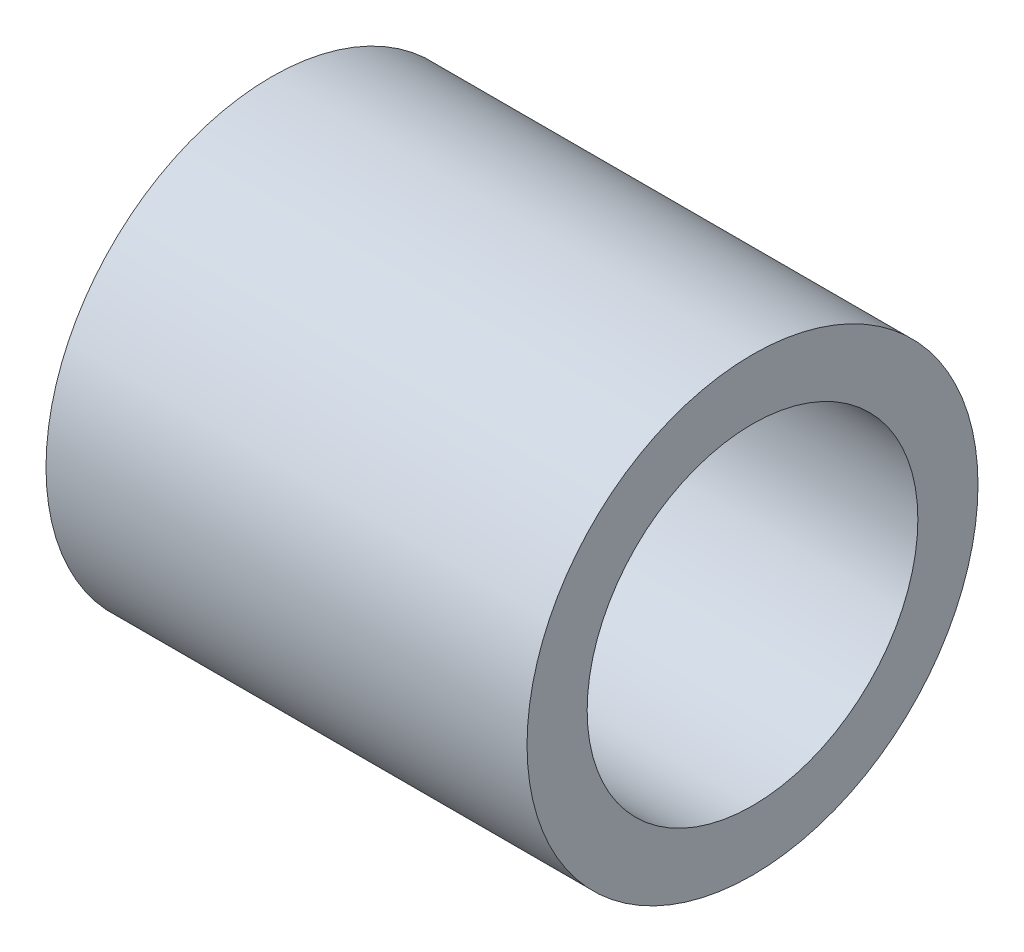
ISO-10303-21;
HEADER;
FILE_DESCRIPTION(('STEP AP214'),'2;1');
FILE_NAME('part.step','',(''),(''),'','','');
FILE_SCHEMA(('AUTOMOTIVE_DESIGN { 1 0 10303 214 1 1 1 1 }'));
ENDSEC;
DATA;
#1=APPLICATION_CONTEXT('core data for automotive mechanical design processes');
#2=APPLICATION_PROTOCOL_DEFINITION('international standard','automotive_design',2000,#1);
#3=PRODUCT_CONTEXT('',#1,'mechanical');
#4=PRODUCT('Part','Part','',(#3));
#5=PRODUCT_RELATED_PRODUCT_CATEGORY('part','',(#4));
#6=PRODUCT_DEFINITION_FORMATION('','',#4);
#7=PRODUCT_DEFINITION_CONTEXT('part definition',#1,'design');
#8=PRODUCT_DEFINITION('design','',#6,#7);
#9=PRODUCT_DEFINITION_SHAPE('','',#8);
#10=(LENGTH_UNIT() NAMED_UNIT(*) SI_UNIT(.MILLI.,.METRE.));
#11=(NAMED_UNIT(*) PLANE_ANGLE_UNIT() SI_UNIT($,.RADIAN.));
#12=(NAMED_UNIT(*) SI_UNIT($,.STERADIAN.) SOLID_ANGLE_UNIT());
#13=UNCERTAINTY_MEASURE_WITH_UNIT(LENGTH_MEASURE(1.E-05),#10,'distance_accuracy_value','');
#14=(GEOMETRIC_REPRESENTATION_CONTEXT(3) GLOBAL_UNCERTAINTY_ASSIGNED_CONTEXT((#13)) GLOBAL_UNIT_ASSIGNED_CONTEXT((#10,
#11,#12)) REPRESENTATION_CONTEXT('',''));
#15=CARTESIAN_POINT('',(0.,0.,0.));
#16=DIRECTION('',(0.,0.,1.));
#17=DIRECTION('',(1.,0.,0.));
#18=AXIS2_PLACEMENT_3D('',#15,#16,#17);
#19=CARTESIAN_POINT('',(-2.5,0.,0.));
#20=DIRECTION('',(-1.,0.,0.));
#21=DIRECTION('',(0.,0.,1.));
#22=AXIS2_PLACEMENT_3D('',#19,#20,#21);
#23=PLANE('',#22);
#24=CARTESIAN_POINT('',(-2.5,0.,0.));
#25=DIRECTION('',(-1.,0.,0.));
#26=DIRECTION('',(0.,0.,1.));
#27=AXIS2_PLACEMENT_3D('',#24,#25,#26);
#28=CIRCLE('',#27,37.5);
#29=CARTESIAN_POINT('',(-2.5,0.,37.5));
#30=VERTEX_POINT('',#29);
#31=EDGE_CURVE('E10',#30,#30,#28,.T.);
#32=ORIENTED_EDGE('',*,*,#31,.T.);
#33=EDGE_LOOP('',(#32));
#34=FACE_BOUND('',#33,.T.);
#35=CARTESIAN_POINT('',(-2.5,0.,0.));
#36=DIRECTION('',(-1.,0.,0.));
#37=DIRECTION('',(0.,0.,1.));
#38=AXIS2_PLACEMENT_3D('',#35,#36,#37);
#39=CIRCLE('',#38,27.5);
#40=CARTESIAN_POINT('',(-2.5,0.,27.5));
#41=VERTEX_POINT('',#40);
#42=EDGE_CURVE('E58',#41,#41,#39,.T.);
#43=ORIENTED_EDGE('',*,*,#42,.F.);
#44=EDGE_LOOP('',(#43));
#45=FACE_BOUND('',#44,.T.);
#46=ADVANCED_FACE('F42',(#34,#45),#23,.T.);
#47=CARTESIAN_POINT('',(77.5,0.,0.));
#48=DIRECTION('',(-1.,0.,0.));
#49=DIRECTION('',(0.,0.,1.));
#50=AXIS2_PLACEMENT_3D('',#47,#48,#49);
#51=PLANE('',#50);
#52=CARTESIAN_POINT('',(77.5,0.,0.));
#53=DIRECTION('',(-1.,0.,0.));
#54=DIRECTION('',(0.,0.,1.));
#55=AXIS2_PLACEMENT_3D('',#52,#53,#54);
#56=CIRCLE('',#55,37.5);
#57=CARTESIAN_POINT('',(77.5,0.,37.5));
#58=VERTEX_POINT('',#57);
#59=EDGE_CURVE('E47',#58,#58,#56,.T.);
#60=ORIENTED_EDGE('',*,*,#59,.F.);
#61=EDGE_LOOP('',(#60));
#62=FACE_BOUND('',#61,.T.);
#63=CARTESIAN_POINT('',(77.5,0.,0.));
#64=DIRECTION('',(-1.,0.,0.));
#65=DIRECTION('',(0.,0.,1.));
#66=AXIS2_PLACEMENT_3D('',#63,#64,#65);
#67=CIRCLE('',#66,27.5);
#68=CARTESIAN_POINT('',(77.5,0.,27.5));
#69=VERTEX_POINT('',#68);
#70=EDGE_CURVE('E60',#69,#69,#67,.T.);
#71=ORIENTED_EDGE('',*,*,#70,.T.);
#72=EDGE_LOOP('',(#71));
#73=FACE_BOUND('',#72,.T.);
#74=ADVANCED_FACE('F91',(#62,#73),#51,.F.);
#75=CARTESIAN_POINT('',(-2.5,0.,0.));
#76=DIRECTION('',(1.,0.,0.));
#77=DIRECTION('',(0.,0.,-1.));
#78=AXIS2_PLACEMENT_3D('',#75,#76,#77);
#79=CYLINDRICAL_SURFACE('',#78,37.5);
#80=CARTESIAN_POINT('',(24.1,0.,-37.5));
#81=CARTESIAN_POINT('',(24.1000082945985,-0.190559723164768,-37.4999979936604));
#82=CARTESIAN_POINT('',(24.1160743538321,-0.381247611908918,-37.4985320160825));
#83=CARTESIAN_POINT('',(24.1799259758223,-0.757342986444864,-37.4928248970775));
#84=CARTESIAN_POINT('',(24.2277470612038,-0.942744315935858,-37.4885806478242));
#85=CARTESIAN_POINT('',(24.3537105804242,-1.30276543085249,-37.4777963886925));
#86=CARTESIAN_POINT('',(24.431835373654,-1.47739142047119,-37.4712577146716));
#87=CARTESIAN_POINT('',(24.6161559263007,-1.81101129714627,-37.4566169886113));
#88=CARTESIAN_POINT('',(24.7223458581285,-1.97000842006819,-37.4485152612264));
#89=CARTESIAN_POINT('',(24.9601239554859,-2.26837251618839,-37.4316298201157));
#90=CARTESIAN_POINT('',(25.0917787478352,-2.40768629751925,-37.4228443542909));
#91=CARTESIAN_POINT('',(25.3766079311434,-2.66227235210448,-37.405596223706));
#92=CARTESIAN_POINT('',(25.5297832874134,-2.77754354634513,-37.3971335734475));
#93=CARTESIAN_POINT('',(25.8536326129838,-2.98095621962976,-37.3814708573294));
#94=CARTESIAN_POINT('',(26.0243364624897,-3.06905031212187,-37.3742730060971));
#95=CARTESIAN_POINT('',(26.3781893284178,-3.21530548089095,-37.3619757110452));
#96=CARTESIAN_POINT('',(26.5613380884652,-3.27346717358699,-37.356876224013));
#97=CARTESIAN_POINT('',(26.9343443708035,-3.35805067815647,-37.3493683000558));
#98=CARTESIAN_POINT('',(27.1241819225011,-3.38455989016692,-37.3469524542422));
#99=CARTESIAN_POINT('',(27.5056261261671,-3.4053560091084,-37.3450621266294));
#100=CARTESIAN_POINT('',(27.6972327392963,-3.39964362178283,-37.3455875804073));
#101=CARTESIAN_POINT('',(28.076175639252,-3.35623084372738,-37.3495137334145));
#102=CARTESIAN_POINT('',(28.2635229300826,-3.31862562307997,-37.3529058781636));
#103=CARTESIAN_POINT('',(28.6292357310132,-3.21264260375577,-37.3621698121043));
#104=CARTESIAN_POINT('',(28.8076011392711,-3.1442644562436,-37.3680416294049));
#105=CARTESIAN_POINT('',(29.1505892209115,-2.97857066105852,-37.3816131526676));
#106=CARTESIAN_POINT('',(29.3151912526011,-2.88121251336735,-37.3893155398465));
#107=CARTESIAN_POINT('',(29.6257543422296,-2.66035295305758,-37.405677957123));
#108=CARTESIAN_POINT('',(29.7717149522195,-2.53685091239689,-37.4143380102238));
#109=CARTESIAN_POINT('',(30.0414051370892,-2.26667648663797,-37.4316780791412));
#110=CARTESIAN_POINT('',(30.1650523414482,-2.11992186105972,-37.4403580537721));
#111=CARTESIAN_POINT('',(30.3859683010405,-1.80769444233154,-37.4567302086562));
#112=CARTESIAN_POINT('',(30.4832370340864,-1.64222163343754,-37.4644223880785));
#113=CARTESIAN_POINT('',(30.6486305832094,-1.29719999747567,-37.4779541452752));
#114=CARTESIAN_POINT('',(30.7167515292785,-1.11764930500237,-37.4837934770168));
#115=CARTESIAN_POINT('',(30.8218570049296,-0.749594234679214,-37.4929589304417));
#116=CARTESIAN_POINT('',(30.8588422995978,-0.561090076960212,-37.4962851138796));
#117=CARTESIAN_POINT('',(30.9005228112243,-0.181192721220252,-37.5000415745191));
#118=CARTESIAN_POINT('',(30.9053317572028,0.0101879024191437,-37.5004820512895));
#119=CARTESIAN_POINT('',(30.8828213176841,0.391032525671056,-37.4984447554869));
#120=CARTESIAN_POINT('',(30.855502287849,0.580496546477275,-37.4959670152191));
#121=CARTESIAN_POINT('',(30.7696056838689,0.951803835993026,-37.4883783880999));
#122=CARTESIAN_POINT('',(30.7110810486894,1.1336594502153,-37.4832719612077));
#123=CARTESIAN_POINT('',(30.5644887427421,1.48497068650434,-37.4709992727654));
#124=CARTESIAN_POINT('',(30.4764205224644,1.65442607785589,-37.4638329729021));
#125=CARTESIAN_POINT('',(30.2729567466451,1.97664281381885,-37.4482177206628));
#126=CARTESIAN_POINT('',(30.1574861072022,2.12935657436759,-37.4397652674117));
#127=CARTESIAN_POINT('',(29.9026034052353,2.4132741751186,-37.4225383699781));
#128=CARTESIAN_POINT('',(29.7631908499511,2.54447757249701,-37.4137639191713));
#129=CARTESIAN_POINT('',(29.4638870674841,2.78204217195324,-37.3968515560699));
#130=CARTESIAN_POINT('',(29.3039366662132,2.88832898001984,-37.3887155970567));
#131=CARTESIAN_POINT('',(28.9683910149125,3.07253266468952,-37.3740299952077));
#132=CARTESIAN_POINT('',(28.7927959455174,3.15044986879775,-37.3674803340596));
#133=CARTESIAN_POINT('',(28.4312054090705,3.27557674616618,-37.3567204436657));
#134=CARTESIAN_POINT('',(28.2452256224982,3.32283142588881,-37.3525067869617));
#135=CARTESIAN_POINT('',(27.867931462473,3.38543819483056,-37.3468849024037));
#136=CARTESIAN_POINT('',(27.6766172125831,3.40079102237681,-37.3454766096231));
#137=CARTESIAN_POINT('',(27.2948241798513,3.39914904180154,-37.3456260408182));
#138=CARTESIAN_POINT('',(27.104344879313,3.38227110956999,-37.3471730482269));
#139=CARTESIAN_POINT('',(26.7289386875149,3.31689098464511,-37.3530359694837));
#140=CARTESIAN_POINT('',(26.5440118038703,3.26838874858054,-37.3573518871293));
#141=CARTESIAN_POINT('',(26.1849558534423,3.14116756200052,-37.3682634526361));
#142=CARTESIAN_POINT('',(26.0108258318946,3.06245128774545,-37.3748588985791));
#143=CARTESIAN_POINT('',(25.678232363726,2.87704905891663,-37.389586767059));
#144=CARTESIAN_POINT('',(25.5197687376125,2.77036342484393,-37.3977191719837));
#145=CARTESIAN_POINT('',(25.2224075495852,2.5316114597032,-37.4146398485466));
#146=CARTESIAN_POINT('',(25.0835798394473,2.39945828320324,-37.4234302995562));
#147=CARTESIAN_POINT('',(24.8300152242307,2.11368749589016,-37.4406566524408));
#148=CARTESIAN_POINT('',(24.7152841311393,1.96006472156028,-37.4490924683881));
#149=CARTESIAN_POINT('',(24.5129856074485,1.63536710454836,-37.4646770938458));
#150=CARTESIAN_POINT('',(24.4254766147713,1.46425575021596,-37.4718231209471));
#151=CARTESIAN_POINT('',(24.2805461182865,1.10981695672428,-37.4839915301108));
#152=CARTESIAN_POINT('',(24.2230903050459,0.92650371833899,-37.4890163325439));
#153=CARTESIAN_POINT('',(24.1544024636543,0.618439145091232,-37.4950975906303));
#154=CARTESIAN_POINT('',(24.134028970738,0.495664227105549,-37.4969275402536));
#155=CARTESIAN_POINT('',(24.1068250549301,0.248611056424633,-37.4993793975079));
#156=CARTESIAN_POINT('',(24.0999945880971,0.124332808608396,-37.5000013090586));
#157=CARTESIAN_POINT('',(24.1,0.,-37.5));
#158=B_SPLINE_CURVE_WITH_KNOTS('',3,(#80,#81,#82,#83,#84,#85,#86,#87,#88,#89,#90,#91,#92,#93,
#94,#95,#96,#97,#98,#99,#100,#101,#102,#103,#104,#105,#106,#107,#108,#109,#110,#111,#112,#113,
#114,#115,#116,#117,#118,#119,#120,#121,#122,#123,#124,#125,#126,#127,#128,#129,#130,#131,#132,
#133,#134,#135,#136,#137,#138,#139,#140,#141,#142,#143,#144,#145,#146,#147,#148,#149,#150,#151,
#152,#153,#154,#155,#156,#157),.UNSPECIFIED.,.T.,.F.,(4,2,2,2,2,2,2,2,2,2,2,2,2,2,2,2,2,2,2,2,2,
2,2,2,2,2,2,2,2,2,2,2,2,2,2,2,2,2,4),(0.,0.57122519146037,1.14309046044219,1.71462332955852,
2.28603761577859,2.85896769645852,3.4319234842914,4.00587271571747,4.57981012692806,
5.15215906623598,5.72449546954545,6.29512997252314,6.8657709442556,7.43725293566329,
8.0087486570644,8.582312737687,9.15587730074411,9.72951799346374,10.3031445898858,
10.8747425965175,11.4463342755211,12.0169593447037,12.5875950280848,13.159812710094,
13.7320421706041,14.3059589873226,14.8798691784049,15.452935066909,16.025987692396,
16.5969662471126,17.167945584901,17.7388743588798,18.3097965908686,18.8827012901644,
19.455744013011,20.0300085353123,20.6036160246026,20.9763194566853,21.3490216794983),.UNSPECIFIED.);
#159=CARTESIAN_POINT('',(24.1,0.,-37.5));
#160=VERTEX_POINT('',#159);
#161=EDGE_CURVE('E64',#160,#160,#158,.T.);
#162=ORIENTED_EDGE('',*,*,#161,.T.);
#163=EDGE_LOOP('',(#162));
#164=FACE_BOUND('',#163,.T.);
#165=ORIENTED_EDGE('',*,*,#31,.F.);
#166=EDGE_LOOP('',(#165));
#167=FACE_BOUND('',#166,.T.);
#168=ORIENTED_EDGE('',*,*,#59,.T.);
#169=EDGE_LOOP('',(#168));
#170=FACE_BOUND('',#169,.T.);
#171=ADVANCED_FACE('F44',(#164,#167,#170),#79,.T.);
#172=CARTESIAN_POINT('',(-2.5,0.,0.));
#173=DIRECTION('',(1.,0.,0.));
#174=DIRECTION('',(0.,0.,-1.));
#175=AXIS2_PLACEMENT_3D('',#172,#173,#174);
#176=CYLINDRICAL_SURFACE('',#175,27.5);
#177=CARTESIAN_POINT('',(24.1,0.,-27.5));
#178=CARTESIAN_POINT('',(24.1000080907516,-0.190201052533412,-27.4999973701128));
#179=CARTESIAN_POINT('',(24.1160140014397,-0.380521373939288,-27.4980058920901));
#180=CARTESIAN_POINT('',(24.1796127201585,-0.755867230549361,-27.4902530469277));
#181=CARTESIAN_POINT('',(24.2272386193167,-0.940887006770609,-27.4844877304586));
#182=CARTESIAN_POINT('',(24.3526537060348,-1.3001434435001,-27.4698367811347));
#183=CARTESIAN_POINT('',(24.4304227154413,-1.4743872272968,-27.4609532360336));
#184=CARTESIAN_POINT('',(24.6138726090077,-1.80731687514573,-27.4410541787323));
#185=CARTESIAN_POINT('',(24.7195486595332,-1.96600542691897,-27.4300390358234));
#186=CARTESIAN_POINT('',(24.9564220540082,-2.2642088667834,-27.4070404624997));
#187=CARTESIAN_POINT('',(25.0877397431592,-2.40362783048447,-27.3950526283184));
#188=CARTESIAN_POINT('',(25.3719104842118,-2.65850847174968,-27.3714953375396));
#189=CARTESIAN_POINT('',(25.524764626714,-2.77396893532872,-27.3599259021672));
#190=CARTESIAN_POINT('',(25.8482913880172,-2.97801139358645,-27.3384719050034));
#191=CARTESIAN_POINT('',(26.019020986791,-3.0665036891226,-27.3285930128999));
#192=CARTESIAN_POINT('',(26.3730603738201,-3.21352500273734,-27.3116965148347));
#193=CARTESIAN_POINT('',(26.5563696948669,-3.27205513292277,-27.3046788026765));
#194=CARTESIAN_POINT('',(26.9293704007987,-3.35719956932054,-27.2943411697018));
#195=CARTESIAN_POINT('',(27.119024319813,-3.38397569091386,-27.2910025070254));
#196=CARTESIAN_POINT('',(27.5001610327091,-3.40535271508316,-27.2883435853789));
#197=CARTESIAN_POINT('',(27.6916437542902,-3.39995488442232,-27.2890231682012));
#198=CARTESIAN_POINT('',(28.0698755967978,-3.35727009195558,-27.2943068033676));
#199=CARTESIAN_POINT('',(28.2566451726266,-3.32016128255794,-27.2988889307214));
#200=CARTESIAN_POINT('',(28.6212855847755,-3.21538583076704,-27.3114271641791));
#201=CARTESIAN_POINT('',(28.7991562442991,-3.14771858153118,-27.3193833372859));
#202=CARTESIAN_POINT('',(29.1415037368225,-2.98355527841873,-27.337798082155));
#203=CARTESIAN_POINT('',(29.3059430239029,-2.88698170972551,-27.3482633671115));
#204=CARTESIAN_POINT('',(29.6163485550434,-2.66780260382185,-27.3705119413259));
#205=CARTESIAN_POINT('',(29.7623139719357,-2.54519590163504,-27.3822952895557));
#206=CARTESIAN_POINT('',(30.032662463945,-2.2764430937849,-27.405949778546));
#207=CARTESIAN_POINT('',(30.156892915838,-2.13014341226582,-27.4178209741423));
#208=CARTESIAN_POINT('',(30.3790569998361,-1.8186866082784,-27.440238975914));
#209=CARTESIAN_POINT('',(30.4769905735223,-1.65352944391895,-27.4507857791473));
#210=CARTESIAN_POINT('',(30.6437806669504,-1.30892889742324,-27.4693730020867));
#211=CARTESIAN_POINT('',(30.7126277391559,-1.12948089596342,-27.4774126072125));
#212=CARTESIAN_POINT('',(30.8191699110892,-0.761449947988202,-27.4900721501504));
#213=CARTESIAN_POINT('',(30.8568664373994,-0.572867420219812,-27.4946922445628));
#214=CARTESIAN_POINT('',(30.8998398916116,-0.193240364143858,-27.4999718646851));
#215=CARTESIAN_POINT('',(30.9053270875831,-0.00221998110672169,-27.5006570773434));
#216=CARTESIAN_POINT('',(30.8842808618475,0.378017656831163,-27.4980590540993));
#217=CARTESIAN_POINT('',(30.8577481069269,0.567234949196941,-27.4947759008346));
#218=CARTESIAN_POINT('',(30.7735898111929,0.937875602231271,-27.4846260824335));
#219=CARTESIAN_POINT('',(30.7160644203541,1.11932204617082,-27.4777709621252));
#220=CARTESIAN_POINT('',(30.5716578383096,1.4699923028629,-27.4612447845299));
#221=CARTESIAN_POINT('',(30.4847756700684,1.6392157085877,-27.4515736335228));
#222=CARTESIAN_POINT('',(30.2836123048665,1.96157602218085,-27.430429791478));
#223=CARTESIAN_POINT('',(30.1691949653791,2.11462738221523,-27.4189482497422));
#224=CARTESIAN_POINT('',(29.9164019071695,2.39942893667683,-27.3954959741226));
#225=CARTESIAN_POINT('',(29.7780252588277,2.53117830420449,-27.3835252212712));
#226=CARTESIAN_POINT('',(29.4803158924695,2.77038106391939,-27.3603645671978));
#227=CARTESIAN_POINT('',(29.3208708299473,2.87769515636146,-27.3491793825824));
#228=CARTESIAN_POINT('',(28.9860963922118,3.06401905686478,-27.3289335351783));
#229=CARTESIAN_POINT('',(28.8107673296669,3.14302942191877,-27.319872830583));
#230=CARTESIAN_POINT('',(28.4496530000694,3.27027707195055,-27.3049338024271));
#231=CARTESIAN_POINT('',(28.2638958509037,3.31859315557057,-27.2990473358616));
#232=CARTESIAN_POINT('',(27.8868275479007,3.38333460140921,-27.2910998009102));
#233=CARTESIAN_POINT('',(27.6955166467843,3.39976141243226,-27.2890385587356));
#234=CARTESIAN_POINT('',(27.3141572189625,3.40023182798889,-27.2889798366935));
#235=CARTESIAN_POINT('',(27.1241089292646,3.38449427538354,-27.2909548942708));
#236=CARTESIAN_POINT('',(26.7493805634436,3.32154584356649,-27.2986872183483));
#237=CARTESIAN_POINT('',(26.5647004882787,3.27433495873739,-27.3044444855237));
#238=CARTESIAN_POINT('',(26.2059781325475,3.14984796136387,-27.319084088062));
#239=CARTESIAN_POINT('',(26.0319322313323,3.07258214845833,-27.3279653527505));
#240=CARTESIAN_POINT('',(25.6992411862613,2.89020015296914,-27.3478540492322));
#241=CARTESIAN_POINT('',(25.5405962188389,2.78508365137908,-27.3588615053787));
#242=CARTESIAN_POINT('',(25.2420914704386,2.54917153701982,-27.3818520601831));
#243=CARTESIAN_POINT('',(25.1023610517422,2.41821280320509,-27.3938410576367));
#244=CARTESIAN_POINT('',(24.8467747778317,2.13467321906678,-27.4173916310047));
#245=CARTESIAN_POINT('',(24.7309245643477,1.9820872736223,-27.4289531053882));
#246=CARTESIAN_POINT('',(24.5260214079437,1.65897452631247,-27.450393366481));
#247=CARTESIAN_POINT('',(24.4370698274523,1.48838305141036,-27.4602657289062));
#248=CARTESIAN_POINT('',(24.2892027253099,1.13465794067573,-27.4771500843894));
#249=CARTESIAN_POINT('',(24.2302544927663,0.951538211918808,-27.4841651908714));
#250=CARTESIAN_POINT('',(24.158213139541,0.639554738740981,-27.4928492552765));
#251=CARTESIAN_POINT('',(24.1364144929242,0.512660055655485,-27.4955177542789));
#252=CARTESIAN_POINT('',(24.1073052392836,0.257195088541461,-27.49909400958));
#253=CARTESIAN_POINT('',(24.0999945285716,0.128624816511513,-27.50000177848));
#254=CARTESIAN_POINT('',(24.1,0.,-27.5));
#255=B_SPLINE_CURVE_WITH_KNOTS('',3,(#177,#178,#179,#180,#181,#182,#183,#184,#185,#186,#187,
#188,#189,#190,#191,#192,#193,#194,#195,#196,#197,#198,#199,#200,#201,#202,#203,#204,#205,#206,
#207,#208,#209,#210,#211,#212,#213,#214,#215,#216,#217,#218,#219,#220,#221,#222,#223,#224,#225,
#226,#227,#228,#229,#230,#231,#232,#233,#234,#235,#236,#237,#238,#239,#240,#241,#242,#243,#244,
#245,#246,#247,#248,#249,#250,#251,#252,#253,#254),.UNSPECIFIED.,.T.,.F.,(4,2,2,2,2,2,2,2,2,2,2,
2,2,2,2,2,2,2,2,2,2,2,2,2,2,2,2,2,2,2,2,2,2,2,2,2,2,2,4),(0.,0.570133339925342,1.14086428147082,
1.71121382700208,2.28146464995597,2.85445914061183,3.42748265800155,4.00239182133894,
4.57727964420343,5.14922513010398,5.72114809733211,6.28987896488851,6.85862112704316,
7.42890229670404,7.99920899168873,8.57337232357912,9.14753693097409,9.72188788867744,
10.2962125417282,10.8667836976864,11.437342972223,12.0060694970457,12.574814951765,
13.1464324240113,13.7180720799484,14.2928931871908,14.8677029818321,15.4410310918959,
16.0143331537095,16.5837475174276,17.1531619827757,17.7223814849622,18.2916075073652,
18.864548672043,19.437625040081,20.0128347729886,20.5874160378538,20.972975529244,
21.3585322612295),.UNSPECIFIED.);
#256=CARTESIAN_POINT('',(24.1,0.,-27.5));
#257=VERTEX_POINT('',#256);
#258=EDGE_CURVE('E74',#257,#257,#255,.T.);
#259=ORIENTED_EDGE('',*,*,#258,.F.);
#260=EDGE_LOOP('',(#259));
#261=FACE_BOUND('',#260,.T.);
#262=ORIENTED_EDGE('',*,*,#42,.T.);
#263=EDGE_LOOP('',(#262));
#264=FACE_BOUND('',#263,.T.);
#265=ORIENTED_EDGE('',*,*,#70,.F.);
#266=EDGE_LOOP('',(#265));
#267=FACE_BOUND('',#266,.T.);
#268=ADVANCED_FACE('F82',(#261,#264,#267),#176,.F.);
#269=CARTESIAN_POINT('',(27.5,0.,-37.5));
#270=DIRECTION('',(0.,0.,-1.));
#271=DIRECTION('',(0.,1.,0.));
#272=AXIS2_PLACEMENT_3D('',#269,#270,#271);
#273=CYLINDRICAL_SURFACE('',#272,3.39999999999999);
#274=ORIENTED_EDGE('',*,*,#258,.T.);
#275=EDGE_LOOP('',(#274));
#276=FACE_BOUND('',#275,.T.);
#277=ORIENTED_EDGE('',*,*,#161,.F.);
#278=EDGE_LOOP('',(#277));
#279=FACE_BOUND('',#278,.T.);
#280=ADVANCED_FACE('F79',(#276,#279),#273,.F.);
#281=CLOSED_SHELL('',(#46,#74,#171,#268,#280));
#282=MANIFOLD_SOLID_BREP('B2',#281);
#283=ADVANCED_BREP_SHAPE_REPRESENTATION('',(#18,#282),#14);
#284=SHAPE_DEFINITION_REPRESENTATION(#9,#283);
ENDSEC;
END-ISO-10303-21;
